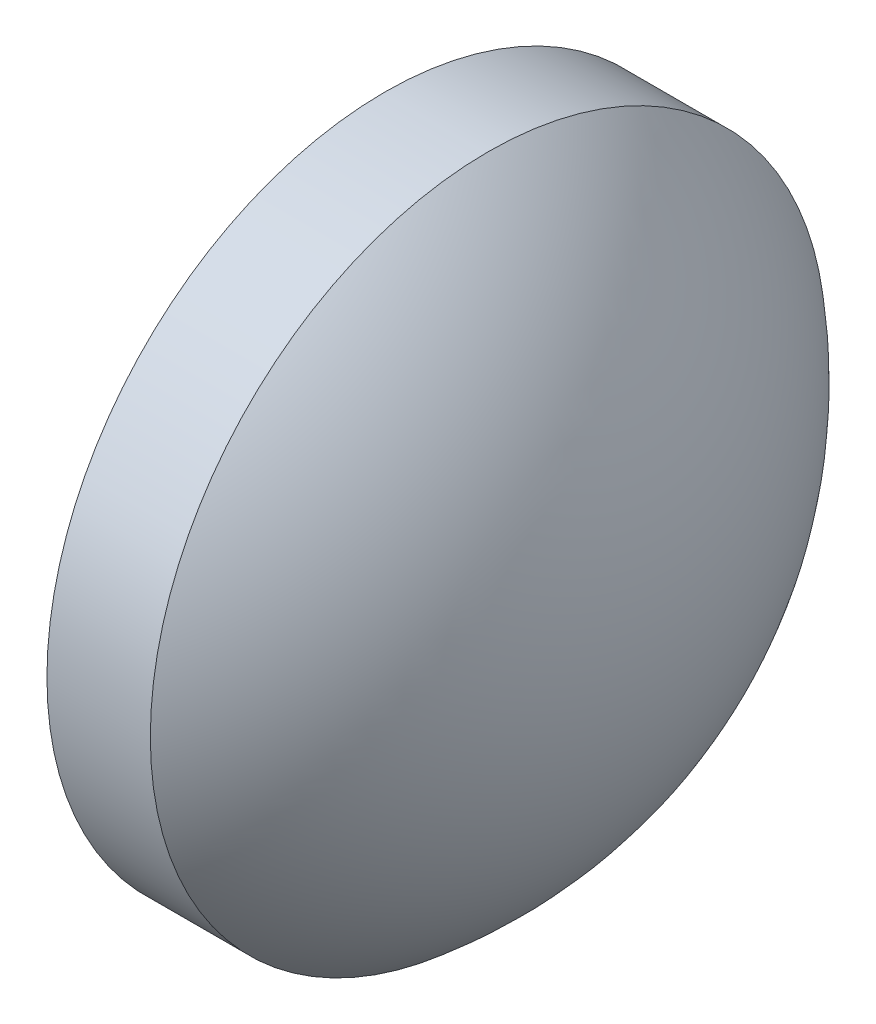
ISO-10303-21;
HEADER;
FILE_DESCRIPTION(('STEP AP214'),'2;1');
FILE_NAME('part.step','',(''),(''),'','','');
FILE_SCHEMA(('AUTOMOTIVE_DESIGN { 1 0 10303 214 1 1 1 1 }'));
ENDSEC;
DATA;
#1=APPLICATION_CONTEXT('core data for automotive mechanical design processes');
#2=APPLICATION_PROTOCOL_DEFINITION('international standard','automotive_design',2000,#1);
#3=PRODUCT_CONTEXT('',#1,'mechanical');
#4=PRODUCT('Part','Part','',(#3));
#5=PRODUCT_RELATED_PRODUCT_CATEGORY('part','',(#4));
#6=PRODUCT_DEFINITION_FORMATION('','',#4);
#7=PRODUCT_DEFINITION_CONTEXT('part definition',#1,'design');
#8=PRODUCT_DEFINITION('design','',#6,#7);
#9=PRODUCT_DEFINITION_SHAPE('','',#8);
#10=(LENGTH_UNIT() NAMED_UNIT(*) SI_UNIT(.MILLI.,.METRE.));
#11=(NAMED_UNIT(*) PLANE_ANGLE_UNIT() SI_UNIT($,.RADIAN.));
#12=(NAMED_UNIT(*) SI_UNIT($,.STERADIAN.) SOLID_ANGLE_UNIT());
#13=UNCERTAINTY_MEASURE_WITH_UNIT(LENGTH_MEASURE(1.E-05),#10,'distance_accuracy_value','');
#14=(GEOMETRIC_REPRESENTATION_CONTEXT(3) GLOBAL_UNCERTAINTY_ASSIGNED_CONTEXT((#13)) GLOBAL_UNIT_ASSIGNED_CONTEXT((#10,
#11,#12)) REPRESENTATION_CONTEXT('',''));
#15=CARTESIAN_POINT('',(0.,0.,0.));
#16=DIRECTION('',(0.,0.,1.));
#17=DIRECTION('',(1.,0.,0.));
#18=AXIS2_PLACEMENT_3D('',#15,#16,#17);
#19=CARTESIAN_POINT('',(533.35036569962,134.376201921337,0.));
#20=DIRECTION('',(-1.,0.,0.));
#21=DIRECTION('',(0.,1.,0.));
#22=AXIS2_PLACEMENT_3D('',#19,#20,#21);
#23=SPHERICAL_SURFACE('',#22,6.45926160337552);
#24=CARTESIAN_POINT('',(537.439627302995,134.376201921337,0.));
#25=DIRECTION('',(-1.,0.,0.));
#26=DIRECTION('',(0.,0.,1.));
#27=AXIS2_PLACEMENT_3D('',#24,#25,#26);
#28=CIRCLE('',#27,5.);
#29=CARTESIAN_POINT('',(537.439627302995,134.376201921337,5.));
#30=VERTEX_POINT('',#29);
#31=EDGE_CURVE('E10',#30,#30,#28,.T.);
#32=ORIENTED_EDGE('',*,*,#31,.F.);
#33=EDGE_LOOP('',(#32));
#34=FACE_BOUND('',#33,.T.);
#35=ADVANCED_FACE('F35',(#34),#23,.T.);
#36=CARTESIAN_POINT('',(534.678106728928,134.376201921337,0.));
#37=DIRECTION('',(-1.,0.,0.));
#38=DIRECTION('',(0.,0.,1.));
#39=AXIS2_PLACEMENT_3D('',#36,#37,#38);
#40=CYLINDRICAL_SURFACE('',#39,5.);
#41=CARTESIAN_POINT('',(535.909627302995,134.376201921337,0.));
#42=DIRECTION('',(-1.,0.,0.));
#43=DIRECTION('',(0.,0.,1.));
#44=AXIS2_PLACEMENT_3D('',#41,#42,#43);
#45=CIRCLE('',#44,5.);
#46=CARTESIAN_POINT('',(535.909627302995,134.376201921337,5.));
#47=VERTEX_POINT('',#46);
#48=EDGE_CURVE('E41',#47,#47,#45,.T.);
#49=ORIENTED_EDGE('',*,*,#48,.F.);
#50=EDGE_LOOP('',(#49));
#51=FACE_BOUND('',#50,.T.);
#52=ORIENTED_EDGE('',*,*,#31,.T.);
#53=EDGE_LOOP('',(#52));
#54=FACE_BOUND('',#53,.T.);
#55=ADVANCED_FACE('F49',(#51,#54),#40,.T.);
#56=CARTESIAN_POINT('',(535.909627302995,134.376201921337,0.));
#57=DIRECTION('',(1.,0.,0.));
#58=DIRECTION('',(0.,0.,-1.));
#59=AXIS2_PLACEMENT_3D('',#56,#57,#58);
#60=PLANE('',#59);
#61=ORIENTED_EDGE('',*,*,#48,.T.);
#62=EDGE_LOOP('',(#61));
#63=FACE_BOUND('',#62,.T.);
#64=ADVANCED_FACE('F47',(#63),#60,.F.);
#65=CLOSED_SHELL('',(#35,#55,#64));
#66=MANIFOLD_SOLID_BREP('B2',#65);
#67=ADVANCED_BREP_SHAPE_REPRESENTATION('',(#18,#66),#14);
#68=SHAPE_DEFINITION_REPRESENTATION(#9,#67);
ENDSEC;
END-ISO-10303-21;
